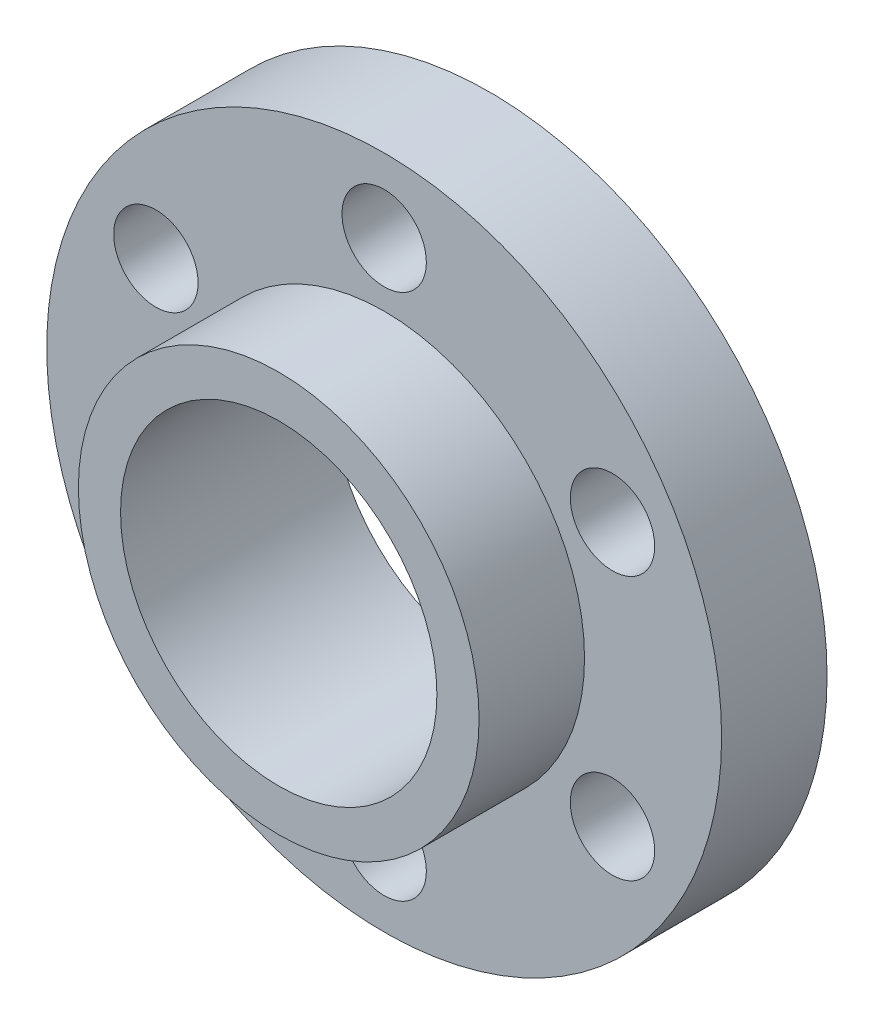
ISO-10303-21;
HEADER;
FILE_DESCRIPTION(('STEP AP214'),'2;1');
FILE_NAME('part.step','',(''),(''),'','','');
FILE_SCHEMA(('AUTOMOTIVE_DESIGN { 1 0 10303 214 1 1 1 1 }'));
ENDSEC;
DATA;
#1=APPLICATION_CONTEXT('core data for automotive mechanical design processes');
#2=APPLICATION_PROTOCOL_DEFINITION('international standard','automotive_design',2000,#1);
#3=PRODUCT_CONTEXT('',#1,'mechanical');
#4=PRODUCT('Part','Part','',(#3));
#5=PRODUCT_RELATED_PRODUCT_CATEGORY('part','',(#4));
#6=PRODUCT_DEFINITION_FORMATION('','',#4);
#7=PRODUCT_DEFINITION_CONTEXT('part definition',#1,'design');
#8=PRODUCT_DEFINITION('design','',#6,#7);
#9=PRODUCT_DEFINITION_SHAPE('','',#8);
#10=(LENGTH_UNIT() NAMED_UNIT(*) SI_UNIT(.MILLI.,.METRE.));
#11=(NAMED_UNIT(*) PLANE_ANGLE_UNIT() SI_UNIT($,.RADIAN.));
#12=(NAMED_UNIT(*) SI_UNIT($,.STERADIAN.) SOLID_ANGLE_UNIT());
#13=UNCERTAINTY_MEASURE_WITH_UNIT(LENGTH_MEASURE(1.E-05),#10,'distance_accuracy_value','');
#14=(GEOMETRIC_REPRESENTATION_CONTEXT(3) GLOBAL_UNCERTAINTY_ASSIGNED_CONTEXT((#13)) GLOBAL_UNIT_ASSIGNED_CONTEXT((#10,
#11,#12)) REPRESENTATION_CONTEXT('',''));
#15=CARTESIAN_POINT('',(0.,0.,0.));
#16=DIRECTION('',(0.,0.,1.));
#17=DIRECTION('',(1.,0.,0.));
#18=AXIS2_PLACEMENT_3D('',#15,#16,#17);
#19=CARTESIAN_POINT('',(0.,0.,10.));
#20=DIRECTION('',(0.,0.,1.));
#21=DIRECTION('',(1.,0.,0.));
#22=AXIS2_PLACEMENT_3D('',#19,#20,#21);
#23=PLANE('',#22);
#24=CARTESIAN_POINT('',(-21.6506350946088,-12.5,10.));
#25=DIRECTION('',(0.,0.,1.));
#26=DIRECTION('',(1.,0.,0.));
#27=AXIS2_PLACEMENT_3D('',#24,#25,#26);
#28=CIRCLE('',#27,4.00000000000329);
#29=CARTESIAN_POINT('',(-17.6506350946055,-12.5,10.));
#30=VERTEX_POINT('',#29);
#31=EDGE_CURVE('E82',#30,#30,#28,.T.);
#32=ORIENTED_EDGE('',*,*,#31,.F.);
#33=EDGE_LOOP('',(#32));
#34=FACE_BOUND('',#33,.T.);
#35=CARTESIAN_POINT('',(2.14907863971536E-12,-24.9999999999982,10.));
#36=DIRECTION('',(0.,0.,1.));
#37=DIRECTION('',(1.,0.,0.));
#38=AXIS2_PLACEMENT_3D('',#35,#36,#37);
#39=CIRCLE('',#38,4.00000000000401);
#40=CARTESIAN_POINT('',(4.00000000000616,-24.9999999999982,10.));
#41=VERTEX_POINT('',#40);
#42=EDGE_CURVE('E90',#41,#41,#39,.T.);
#43=ORIENTED_EDGE('',*,*,#42,.F.);
#44=EDGE_LOOP('',(#43));
#45=FACE_BOUND('',#44,.T.);
#46=CARTESIAN_POINT('',(21.6506350946115,-12.4999999999972,10.));
#47=DIRECTION('',(0.,0.,1.));
#48=DIRECTION('',(1.,0.,0.));
#49=AXIS2_PLACEMENT_3D('',#46,#47,#48);
#50=CIRCLE('',#49,4.00000000000497);
#51=CARTESIAN_POINT('',(25.6506350946165,-12.4999999999972,10.));
#52=VERTEX_POINT('',#51);
#53=EDGE_CURVE('E98',#52,#52,#50,.T.);
#54=ORIENTED_EDGE('',*,*,#53,.F.);
#55=EDGE_LOOP('',(#54));
#56=FACE_BOUND('',#55,.T.);
#57=CARTESIAN_POINT('',(21.6506350946099,12.5000000000019,10.));
#58=DIRECTION('',(0.,0.,1.));
#59=DIRECTION('',(1.,0.,0.));
#60=AXIS2_PLACEMENT_3D('',#57,#58,#59);
#61=CIRCLE('',#60,4.00000000000517);
#62=CARTESIAN_POINT('',(25.6506350946151,12.5000000000019,10.));
#63=VERTEX_POINT('',#62);
#64=EDGE_CURVE('E106',#63,#63,#61,.T.);
#65=ORIENTED_EDGE('',*,*,#64,.F.);
#66=EDGE_LOOP('',(#65));
#67=FACE_BOUND('',#66,.T.);
#68=CARTESIAN_POINT('',(-1.09130313639288E-12,25.,10.));
#69=DIRECTION('',(0.,0.,1.));
#70=DIRECTION('',(1.,0.,0.));
#71=AXIS2_PLACEMENT_3D('',#68,#69,#70);
#72=CIRCLE('',#71,4.00000000000437);
#73=CARTESIAN_POINT('',(4.00000000000328,25.,10.));
#74=VERTEX_POINT('',#73);
#75=EDGE_CURVE('E114',#74,#74,#72,.T.);
#76=ORIENTED_EDGE('',*,*,#75,.F.);
#77=EDGE_LOOP('',(#76));
#78=FACE_BOUND('',#77,.T.);
#79=CARTESIAN_POINT('',(-21.6506350946104,12.4999999999991,10.));
#80=DIRECTION('',(0.,0.,1.));
#81=DIRECTION('',(1.,0.,0.));
#82=AXIS2_PLACEMENT_3D('',#79,#80,#81);
#83=CIRCLE('',#82,4.0000000000033);
#84=CARTESIAN_POINT('',(-17.6506350946071,12.4999999999991,10.));
#85=VERTEX_POINT('',#84);
#86=EDGE_CURVE('E74',#85,#85,#83,.T.);
#87=ORIENTED_EDGE('',*,*,#86,.F.);
#88=EDGE_LOOP('',(#87));
#89=FACE_BOUND('',#88,.T.);
#90=CARTESIAN_POINT('',(0.,0.,10.));
#91=DIRECTION('',(0.,0.,1.));
#92=DIRECTION('',(1.,0.,0.));
#93=AXIS2_PLACEMENT_3D('',#90,#91,#92);
#94=CIRCLE('',#93,32.);
#95=CARTESIAN_POINT('',(32.,0.,10.));
#96=VERTEX_POINT('',#95);
#97=EDGE_CURVE('E11',#96,#96,#94,.T.);
#98=ORIENTED_EDGE('',*,*,#97,.T.);
#99=EDGE_LOOP('',(#98));
#100=FACE_BOUND('',#99,.T.);
#101=CARTESIAN_POINT('',(0.,0.,10.));
#102=DIRECTION('',(0.,0.,1.));
#103=DIRECTION('',(1.,0.,0.));
#104=AXIS2_PLACEMENT_3D('',#101,#102,#103);
#105=CIRCLE('',#104,19.);
#106=CARTESIAN_POINT('',(19.,0.,10.));
#107=VERTEX_POINT('',#106);
#108=EDGE_CURVE('E62',#107,#107,#105,.T.);
#109=ORIENTED_EDGE('',*,*,#108,.F.);
#110=EDGE_LOOP('',(#109));
#111=FACE_BOUND('',#110,.T.);
#112=ADVANCED_FACE('F43',(#34,#45,#56,#67,#78,#89,#100,#111),#23,.T.);
#113=CARTESIAN_POINT('',(0.,0.,0.));
#114=DIRECTION('',(0.,0.,1.));
#115=DIRECTION('',(1.,0.,0.));
#116=AXIS2_PLACEMENT_3D('',#113,#114,#115);
#117=PLANE('',#116);
#118=CARTESIAN_POINT('',(-21.6506350946088,-12.5,0.));
#119=DIRECTION('',(0.,0.,1.));
#120=DIRECTION('',(1.,0.,0.));
#121=AXIS2_PLACEMENT_3D('',#118,#119,#120);
#122=CIRCLE('',#121,4.00000000000329);
#123=CARTESIAN_POINT('',(-17.6506350946055,-12.5,0.));
#124=VERTEX_POINT('',#123);
#125=EDGE_CURVE('E86',#124,#124,#122,.T.);
#126=ORIENTED_EDGE('',*,*,#125,.T.);
#127=EDGE_LOOP('',(#126));
#128=FACE_BOUND('',#127,.T.);
#129=CARTESIAN_POINT('',(2.14907863971536E-12,-24.9999999999982,0.));
#130=DIRECTION('',(0.,0.,1.));
#131=DIRECTION('',(1.,0.,0.));
#132=AXIS2_PLACEMENT_3D('',#129,#130,#131);
#133=CIRCLE('',#132,4.00000000000401);
#134=CARTESIAN_POINT('',(4.00000000000616,-24.9999999999982,0.));
#135=VERTEX_POINT('',#134);
#136=EDGE_CURVE('E94',#135,#135,#133,.T.);
#137=ORIENTED_EDGE('',*,*,#136,.T.);
#138=EDGE_LOOP('',(#137));
#139=FACE_BOUND('',#138,.T.);
#140=CARTESIAN_POINT('',(21.6506350946115,-12.4999999999972,0.));
#141=DIRECTION('',(0.,0.,1.));
#142=DIRECTION('',(1.,0.,0.));
#143=AXIS2_PLACEMENT_3D('',#140,#141,#142);
#144=CIRCLE('',#143,4.00000000000497);
#145=CARTESIAN_POINT('',(25.6506350946165,-12.4999999999972,0.));
#146=VERTEX_POINT('',#145);
#147=EDGE_CURVE('E102',#146,#146,#144,.T.);
#148=ORIENTED_EDGE('',*,*,#147,.T.);
#149=EDGE_LOOP('',(#148));
#150=FACE_BOUND('',#149,.T.);
#151=CARTESIAN_POINT('',(21.6506350946099,12.5000000000019,0.));
#152=DIRECTION('',(0.,0.,1.));
#153=DIRECTION('',(1.,0.,0.));
#154=AXIS2_PLACEMENT_3D('',#151,#152,#153);
#155=CIRCLE('',#154,4.00000000000517);
#156=CARTESIAN_POINT('',(25.6506350946151,12.5000000000019,0.));
#157=VERTEX_POINT('',#156);
#158=EDGE_CURVE('E110',#157,#157,#155,.T.);
#159=ORIENTED_EDGE('',*,*,#158,.T.);
#160=EDGE_LOOP('',(#159));
#161=FACE_BOUND('',#160,.T.);
#162=CARTESIAN_POINT('',(-1.09130313639288E-12,25.,0.));
#163=DIRECTION('',(0.,0.,1.));
#164=DIRECTION('',(1.,0.,0.));
#165=AXIS2_PLACEMENT_3D('',#162,#163,#164);
#166=CIRCLE('',#165,4.00000000000437);
#167=CARTESIAN_POINT('',(4.00000000000328,25.,0.));
#168=VERTEX_POINT('',#167);
#169=EDGE_CURVE('E78',#168,#168,#166,.T.);
#170=ORIENTED_EDGE('',*,*,#169,.T.);
#171=EDGE_LOOP('',(#170));
#172=FACE_BOUND('',#171,.T.);
#173=CARTESIAN_POINT('',(-21.6506350946104,12.4999999999991,0.));
#174=DIRECTION('',(0.,0.,1.));
#175=DIRECTION('',(1.,0.,0.));
#176=AXIS2_PLACEMENT_3D('',#173,#174,#175);
#177=CIRCLE('',#176,4.0000000000033);
#178=CARTESIAN_POINT('',(-17.6506350946071,12.4999999999991,0.));
#179=VERTEX_POINT('',#178);
#180=EDGE_CURVE('E73',#179,#179,#177,.T.);
#181=ORIENTED_EDGE('',*,*,#180,.T.);
#182=EDGE_LOOP('',(#181));
#183=FACE_BOUND('',#182,.T.);
#184=CARTESIAN_POINT('',(0.,0.,0.));
#185=DIRECTION('',(0.,0.,1.));
#186=DIRECTION('',(1.,0.,0.));
#187=AXIS2_PLACEMENT_3D('',#184,#185,#186);
#188=CIRCLE('',#187,32.);
#189=CARTESIAN_POINT('',(32.,0.,0.));
#190=VERTEX_POINT('',#189);
#191=EDGE_CURVE('E47',#190,#190,#188,.T.);
#192=ORIENTED_EDGE('',*,*,#191,.F.);
#193=EDGE_LOOP('',(#192));
#194=FACE_BOUND('',#193,.T.);
#195=CARTESIAN_POINT('',(0.,0.,0.));
#196=DIRECTION('',(0.,0.,1.));
#197=DIRECTION('',(1.,0.,0.));
#198=AXIS2_PLACEMENT_3D('',#195,#196,#197);
#199=CIRCLE('',#198,15.);
#200=CARTESIAN_POINT('',(15.,0.,0.));
#201=VERTEX_POINT('',#200);
#202=EDGE_CURVE('E56',#201,#201,#199,.T.);
#203=ORIENTED_EDGE('',*,*,#202,.T.);
#204=EDGE_LOOP('',(#203));
#205=FACE_BOUND('',#204,.T.);
#206=ADVANCED_FACE('F122',(#128,#139,#150,#161,#172,#183,#194,#205),#117,.F.);
#207=CARTESIAN_POINT('',(0.,0.,10.));
#208=DIRECTION('',(0.,0.,-1.));
#209=DIRECTION('',(-1.,0.,0.));
#210=AXIS2_PLACEMENT_3D('',#207,#208,#209);
#211=CYLINDRICAL_SURFACE('',#210,32.);
#212=ORIENTED_EDGE('',*,*,#97,.F.);
#213=EDGE_LOOP('',(#212));
#214=FACE_BOUND('',#213,.T.);
#215=ORIENTED_EDGE('',*,*,#191,.T.);
#216=EDGE_LOOP('',(#215));
#217=FACE_BOUND('',#216,.T.);
#218=ADVANCED_FACE('F45',(#214,#217),#211,.T.);
#219=CARTESIAN_POINT('',(0.,0.,10.));
#220=DIRECTION('',(0.,0.,-1.));
#221=DIRECTION('',(-1.,0.,0.));
#222=AXIS2_PLACEMENT_3D('',#219,#220,#221);
#223=CYLINDRICAL_SURFACE('',#222,15.);
#224=ORIENTED_EDGE('',*,*,#202,.F.);
#225=EDGE_LOOP('',(#224));
#226=FACE_BOUND('',#225,.T.);
#227=CARTESIAN_POINT('',(0.,0.,20.));
#228=DIRECTION('',(0.,0.,1.));
#229=DIRECTION('',(1.,0.,0.));
#230=AXIS2_PLACEMENT_3D('',#227,#228,#229);
#231=CIRCLE('',#230,15.);
#232=CARTESIAN_POINT('',(15.,0.,20.));
#233=VERTEX_POINT('',#232);
#234=EDGE_CURVE('E66',#233,#233,#231,.T.);
#235=ORIENTED_EDGE('',*,*,#234,.T.);
#236=EDGE_LOOP('',(#235));
#237=FACE_BOUND('',#236,.T.);
#238=ADVANCED_FACE('F152',(#226,#237),#223,.F.);
#239=CARTESIAN_POINT('',(0.,0.,20.));
#240=DIRECTION('',(0.,0.,1.));
#241=DIRECTION('',(1.,0.,0.));
#242=AXIS2_PLACEMENT_3D('',#239,#240,#241);
#243=PLANE('',#242);
#244=CARTESIAN_POINT('',(0.,0.,20.));
#245=DIRECTION('',(0.,0.,1.));
#246=DIRECTION('',(1.,0.,0.));
#247=AXIS2_PLACEMENT_3D('',#244,#245,#246);
#248=CIRCLE('',#247,19.);
#249=CARTESIAN_POINT('',(19.,0.,20.));
#250=VERTEX_POINT('',#249);
#251=EDGE_CURVE('E61',#250,#250,#248,.T.);
#252=ORIENTED_EDGE('',*,*,#251,.T.);
#253=EDGE_LOOP('',(#252));
#254=FACE_BOUND('',#253,.T.);
#255=ORIENTED_EDGE('',*,*,#234,.F.);
#256=EDGE_LOOP('',(#255));
#257=FACE_BOUND('',#256,.T.);
#258=ADVANCED_FACE('F143',(#254,#257),#243,.T.);
#259=CARTESIAN_POINT('',(0.,0.,20.));
#260=DIRECTION('',(0.,0.,-1.));
#261=DIRECTION('',(-1.,0.,0.));
#262=AXIS2_PLACEMENT_3D('',#259,#260,#261);
#263=CYLINDRICAL_SURFACE('',#262,19.);
#264=ORIENTED_EDGE('',*,*,#251,.F.);
#265=EDGE_LOOP('',(#264));
#266=FACE_BOUND('',#265,.T.);
#267=ORIENTED_EDGE('',*,*,#108,.T.);
#268=EDGE_LOOP('',(#267));
#269=FACE_BOUND('',#268,.T.);
#270=ADVANCED_FACE('F141',(#266,#269),#263,.T.);
#271=CARTESIAN_POINT('',(-21.6506350946104,12.4999999999991,0.));
#272=DIRECTION('',(0.,0.,1.));
#273=DIRECTION('',(1.,0.,0.));
#274=AXIS2_PLACEMENT_3D('',#271,#272,#273);
#275=CYLINDRICAL_SURFACE('',#274,4.0000000000033);
#276=ORIENTED_EDGE('',*,*,#180,.F.);
#277=EDGE_LOOP('',(#276));
#278=FACE_BOUND('',#277,.T.);
#279=ORIENTED_EDGE('',*,*,#86,.T.);
#280=EDGE_LOOP('',(#279));
#281=FACE_BOUND('',#280,.T.);
#282=ADVANCED_FACE('F129',(#278,#281),#275,.F.);
#283=CARTESIAN_POINT('',(-1.09130313639288E-12,25.,0.));
#284=DIRECTION('',(0.,0.,1.));
#285=DIRECTION('',(1.,0.,0.));
#286=AXIS2_PLACEMENT_3D('',#283,#284,#285);
#287=CYLINDRICAL_SURFACE('',#286,4.00000000000437);
#288=ORIENTED_EDGE('',*,*,#169,.F.);
#289=EDGE_LOOP('',(#288));
#290=FACE_BOUND('',#289,.T.);
#291=ORIENTED_EDGE('',*,*,#75,.T.);
#292=EDGE_LOOP('',(#291));
#293=FACE_BOUND('',#292,.T.);
#294=ADVANCED_FACE('F125',(#290,#293),#287,.F.);
#295=CARTESIAN_POINT('',(21.6506350946099,12.5000000000019,0.));
#296=DIRECTION('',(0.,0.,1.));
#297=DIRECTION('',(1.,0.,0.));
#298=AXIS2_PLACEMENT_3D('',#295,#296,#297);
#299=CYLINDRICAL_SURFACE('',#298,4.00000000000517);
#300=ORIENTED_EDGE('',*,*,#158,.F.);
#301=EDGE_LOOP('',(#300));
#302=FACE_BOUND('',#301,.T.);
#303=ORIENTED_EDGE('',*,*,#64,.T.);
#304=EDGE_LOOP('',(#303));
#305=FACE_BOUND('',#304,.T.);
#306=ADVANCED_FACE('F128',(#302,#305),#299,.F.);
#307=CARTESIAN_POINT('',(21.6506350946115,-12.4999999999972,0.));
#308=DIRECTION('',(0.,0.,1.));
#309=DIRECTION('',(1.,0.,0.));
#310=AXIS2_PLACEMENT_3D('',#307,#308,#309);
#311=CYLINDRICAL_SURFACE('',#310,4.00000000000497);
#312=ORIENTED_EDGE('',*,*,#147,.F.);
#313=EDGE_LOOP('',(#312));
#314=FACE_BOUND('',#313,.T.);
#315=ORIENTED_EDGE('',*,*,#53,.T.);
#316=EDGE_LOOP('',(#315));
#317=FACE_BOUND('',#316,.T.);
#318=ADVANCED_FACE('F175',(#314,#317),#311,.F.);
#319=CARTESIAN_POINT('',(2.14907863971536E-12,-24.9999999999982,0.));
#320=DIRECTION('',(0.,0.,1.));
#321=DIRECTION('',(1.,0.,0.));
#322=AXIS2_PLACEMENT_3D('',#319,#320,#321);
#323=CYLINDRICAL_SURFACE('',#322,4.00000000000401);
#324=ORIENTED_EDGE('',*,*,#136,.F.);
#325=EDGE_LOOP('',(#324));
#326=FACE_BOUND('',#325,.T.);
#327=ORIENTED_EDGE('',*,*,#42,.T.);
#328=EDGE_LOOP('',(#327));
#329=FACE_BOUND('',#328,.T.);
#330=ADVANCED_FACE('F182',(#326,#329),#323,.F.);
#331=CARTESIAN_POINT('',(-21.6506350946088,-12.5,0.));
#332=DIRECTION('',(0.,0.,1.));
#333=DIRECTION('',(1.,0.,0.));
#334=AXIS2_PLACEMENT_3D('',#331,#332,#333);
#335=CYLINDRICAL_SURFACE('',#334,4.00000000000329);
#336=ORIENTED_EDGE('',*,*,#125,.F.);
#337=EDGE_LOOP('',(#336));
#338=FACE_BOUND('',#337,.T.);
#339=ORIENTED_EDGE('',*,*,#31,.T.);
#340=EDGE_LOOP('',(#339));
#341=FACE_BOUND('',#340,.T.);
#342=ADVANCED_FACE('F188',(#338,#341),#335,.F.);
#343=CLOSED_SHELL('',(#112,#206,#218,#238,#258,#270,#282,#294,#306,#318,#330,#342));
#344=MANIFOLD_SOLID_BREP('B2',#343);
#345=ADVANCED_BREP_SHAPE_REPRESENTATION('',(#18,#344),#14);
#346=SHAPE_DEFINITION_REPRESENTATION(#9,#345);
ENDSEC;
END-ISO-10303-21;
